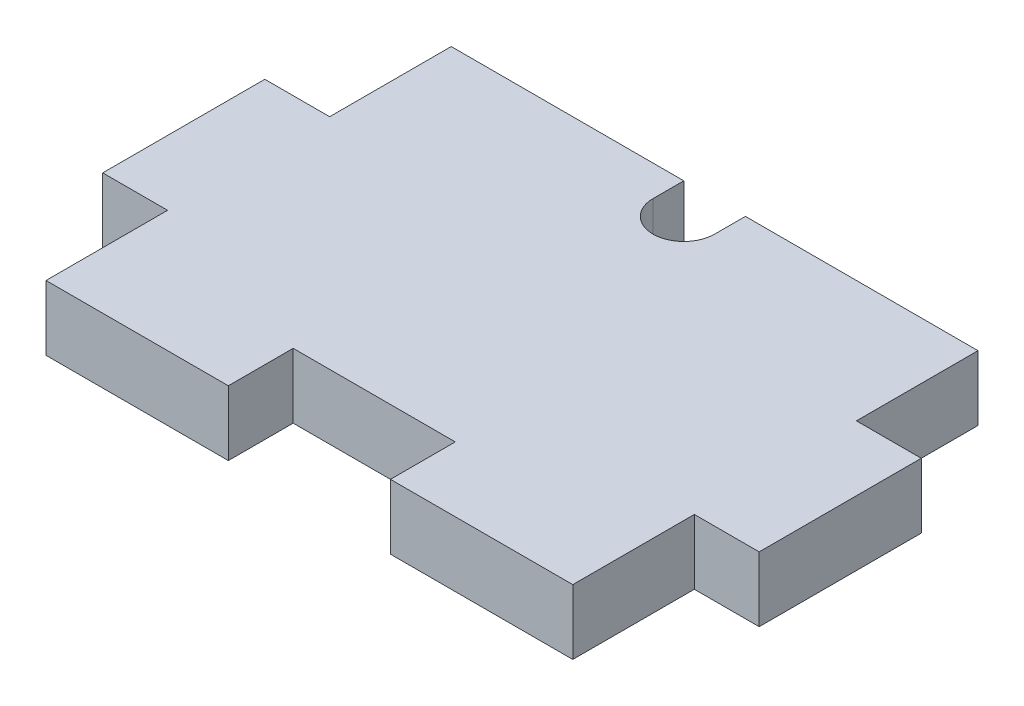
ISO-10303-21;
HEADER;
FILE_DESCRIPTION(('STEP AP214'),'2;1');
FILE_NAME('part.step','',(''),(''),'','','');
FILE_SCHEMA(('AUTOMOTIVE_DESIGN { 1 0 10303 214 1 1 1 1 }'));
ENDSEC;
DATA;
#1=APPLICATION_CONTEXT('core data for automotive mechanical design processes');
#2=APPLICATION_PROTOCOL_DEFINITION('international standard','automotive_design',2000,#1);
#3=PRODUCT_CONTEXT('',#1,'mechanical');
#4=PRODUCT('Part','Part','',(#3));
#5=PRODUCT_RELATED_PRODUCT_CATEGORY('part','',(#4));
#6=PRODUCT_DEFINITION_FORMATION('','',#4);
#7=PRODUCT_DEFINITION_CONTEXT('part definition',#1,'design');
#8=PRODUCT_DEFINITION('design','',#6,#7);
#9=PRODUCT_DEFINITION_SHAPE('','',#8);
#10=(LENGTH_UNIT() NAMED_UNIT(*) SI_UNIT(.MILLI.,.METRE.));
#11=(NAMED_UNIT(*) PLANE_ANGLE_UNIT() SI_UNIT($,.RADIAN.));
#12=(NAMED_UNIT(*) SI_UNIT($,.STERADIAN.) SOLID_ANGLE_UNIT());
#13=UNCERTAINTY_MEASURE_WITH_UNIT(LENGTH_MEASURE(1.E-05),#10,'distance_accuracy_value','');
#14=(GEOMETRIC_REPRESENTATION_CONTEXT(3) GLOBAL_UNCERTAINTY_ASSIGNED_CONTEXT((#13)) GLOBAL_UNIT_ASSIGNED_CONTEXT((#10,
#11,#12)) REPRESENTATION_CONTEXT('',''));
#15=CARTESIAN_POINT('',(0.,0.,0.));
#16=DIRECTION('',(0.,0.,1.));
#17=DIRECTION('',(1.,0.,0.));
#18=AXIS2_PLACEMENT_3D('',#15,#16,#17);
#19=CARTESIAN_POINT('',(0.,4.,25.));
#20=DIRECTION('',(0.,0.,-1.));
#21=DIRECTION('',(-1.,0.,0.));
#22=AXIS2_PLACEMENT_3D('',#19,#20,#21);
#23=PLANE('',#22);
#24=DIRECTION('',(1.,0.,0.));
#25=VECTOR('',#24,1.);
#26=CARTESIAN_POINT('',(0.,0.,25.));
#27=LINE('',#26,#25);
#28=CARTESIAN_POINT('',(0.,0.,25.));
#29=VERTEX_POINT('',#28);
#30=CARTESIAN_POINT('',(11.25,0.,25.));
#31=VERTEX_POINT('',#30);
#32=EDGE_CURVE('E192',#29,#31,#27,.T.);
#33=ORIENTED_EDGE('',*,*,#32,.T.);
#34=DIRECTION('',(0.,1.,0.));
#35=VECTOR('',#34,1.);
#36=CARTESIAN_POINT('',(11.25,0.,25.));
#37=LINE('',#36,#35);
#38=CARTESIAN_POINT('',(11.25,4.,25.));
#39=VERTEX_POINT('',#38);
#40=EDGE_CURVE('E174',#31,#39,#37,.T.);
#41=ORIENTED_EDGE('',*,*,#40,.T.);
#42=DIRECTION('',(1.,0.,0.));
#43=VECTOR('',#42,1.);
#44=CARTESIAN_POINT('',(0.,4.,25.));
#45=LINE('',#44,#43);
#46=CARTESIAN_POINT('',(0.,4.,25.));
#47=VERTEX_POINT('',#46);
#48=EDGE_CURVE('E316',#47,#39,#45,.T.);
#49=ORIENTED_EDGE('',*,*,#48,.F.);
#50=DIRECTION('',(0.,-1.,0.));
#51=VECTOR('',#50,1.);
#52=CARTESIAN_POINT('',(0.,4.,25.));
#53=LINE('',#52,#51);
#54=EDGE_CURVE('E12',#47,#29,#53,.T.);
#55=ORIENTED_EDGE('',*,*,#54,.T.);
#56=EDGE_LOOP('',(#33,#41,#49,#55));
#57=FACE_BOUND('',#56,.T.);
#58=ADVANCED_FACE('F37',(#57),#23,.F.);
#59=CARTESIAN_POINT('',(32.5,4.,0.));
#60=DIRECTION('',(-1.,0.,0.));
#61=DIRECTION('',(0.,0.,1.));
#62=AXIS2_PLACEMENT_3D('',#59,#60,#61);
#63=PLANE('',#62);
#64=DIRECTION('',(0.,1.,0.));
#65=VECTOR('',#64,1.);
#66=CARTESIAN_POINT('',(32.5,0.,7.5));
#67=LINE('',#66,#65);
#68=CARTESIAN_POINT('',(32.5,0.,7.5));
#69=VERTEX_POINT('',#68);
#70=CARTESIAN_POINT('',(32.5,4.,7.5));
#71=VERTEX_POINT('',#70);
#72=EDGE_CURVE('E247',#69,#71,#67,.T.);
#73=ORIENTED_EDGE('',*,*,#72,.F.);
#74=DIRECTION('',(0.,0.,-1.));
#75=VECTOR('',#74,1.);
#76=CARTESIAN_POINT('',(32.5,0.,0.));
#77=LINE('',#76,#75);
#78=CARTESIAN_POINT('',(32.5,0.,0.));
#79=VERTEX_POINT('',#78);
#80=EDGE_CURVE('E199',#69,#79,#77,.T.);
#81=ORIENTED_EDGE('',*,*,#80,.T.);
#82=DIRECTION('',(0.,-1.,0.));
#83=VECTOR('',#82,1.);
#84=CARTESIAN_POINT('',(32.5,4.,0.));
#85=LINE('',#84,#83);
#86=CARTESIAN_POINT('',(32.5,4.,0.));
#87=VERTEX_POINT('',#86);
#88=EDGE_CURVE('E328',#87,#79,#85,.T.);
#89=ORIENTED_EDGE('',*,*,#88,.F.);
#90=DIRECTION('',(0.,0.,-1.));
#91=VECTOR('',#90,1.);
#92=CARTESIAN_POINT('',(32.5,4.,0.));
#93=LINE('',#92,#91);
#94=EDGE_CURVE('E318',#71,#87,#93,.T.);
#95=ORIENTED_EDGE('',*,*,#94,.F.);
#96=EDGE_LOOP('',(#73,#81,#89,#95));
#97=FACE_BOUND('',#96,.T.);
#98=ADVANCED_FACE('F428',(#97),#63,.F.);
#99=CARTESIAN_POINT('',(0.,4.,0.));
#100=DIRECTION('',(1.,0.,0.));
#101=DIRECTION('',(0.,0.,-1.));
#102=AXIS2_PLACEMENT_3D('',#99,#100,#101);
#103=PLANE('',#102);
#104=DIRECTION('',(0.,1.,0.));
#105=VECTOR('',#104,1.);
#106=CARTESIAN_POINT('',(0.,0.,17.5));
#107=LINE('',#106,#105);
#108=CARTESIAN_POINT('',(0.,0.,17.5));
#109=VERTEX_POINT('',#108);
#110=CARTESIAN_POINT('',(0.,4.,17.5));
#111=VERTEX_POINT('',#110);
#112=EDGE_CURVE('E298',#109,#111,#107,.T.);
#113=ORIENTED_EDGE('',*,*,#112,.F.);
#114=DIRECTION('',(0.,0.,1.));
#115=VECTOR('',#114,1.);
#116=CARTESIAN_POINT('',(0.,0.,0.));
#117=LINE('',#116,#115);
#118=EDGE_CURVE('E305',#109,#29,#117,.T.);
#119=ORIENTED_EDGE('',*,*,#118,.T.);
#120=ORIENTED_EDGE('',*,*,#54,.F.);
#121=DIRECTION('',(0.,0.,1.));
#122=VECTOR('',#121,1.);
#123=CARTESIAN_POINT('',(0.,4.,0.));
#124=LINE('',#123,#122);
#125=EDGE_CURVE('E272',#111,#47,#124,.T.);
#126=ORIENTED_EDGE('',*,*,#125,.F.);
#127=EDGE_LOOP('',(#113,#119,#120,#126));
#128=FACE_BOUND('',#127,.T.);
#129=ADVANCED_FACE('F374',(#128),#103,.F.);
#130=CARTESIAN_POINT('',(0.,4.,0.));
#131=DIRECTION('',(0.,0.,1.));
#132=DIRECTION('',(1.,0.,0.));
#133=AXIS2_PLACEMENT_3D('',#130,#131,#132);
#134=PLANE('',#133);
#135=DIRECTION('',(0.,1.,0.));
#136=VECTOR('',#135,1.);
#137=CARTESIAN_POINT('',(14.35,0.,0.));
#138=LINE('',#137,#136);
#139=CARTESIAN_POINT('',(14.35,0.,0.));
#140=VERTEX_POINT('',#139);
#141=CARTESIAN_POINT('',(14.35,4.,0.));
#142=VERTEX_POINT('',#141);
#143=EDGE_CURVE('E306',#140,#142,#138,.T.);
#144=ORIENTED_EDGE('',*,*,#143,.F.);
#145=DIRECTION('',(-1.,0.,0.));
#146=VECTOR('',#145,1.);
#147=CARTESIAN_POINT('',(0.,0.,0.));
#148=LINE('',#147,#146);
#149=CARTESIAN_POINT('',(0.,0.,0.));
#150=VERTEX_POINT('',#149);
#151=EDGE_CURVE('E273',#140,#150,#148,.T.);
#152=ORIENTED_EDGE('',*,*,#151,.T.);
#153=DIRECTION('',(0.,-1.,0.));
#154=VECTOR('',#153,1.);
#155=CARTESIAN_POINT('',(0.,4.,0.));
#156=LINE('',#155,#154);
#157=CARTESIAN_POINT('',(0.,4.,0.));
#158=VERTEX_POINT('',#157);
#159=EDGE_CURVE('E274',#158,#150,#156,.T.);
#160=ORIENTED_EDGE('',*,*,#159,.F.);
#161=DIRECTION('',(-1.,0.,0.));
#162=VECTOR('',#161,1.);
#163=CARTESIAN_POINT('',(0.,4.,0.));
#164=LINE('',#163,#162);
#165=EDGE_CURVE('E321',#142,#158,#164,.T.);
#166=ORIENTED_EDGE('',*,*,#165,.F.);
#167=EDGE_LOOP('',(#144,#152,#160,#166));
#168=FACE_BOUND('',#167,.T.);
#169=ADVANCED_FACE('F338',(#168),#134,.F.);
#170=CARTESIAN_POINT('',(0.,4.,0.));
#171=DIRECTION('',(0.,1.,0.));
#172=DIRECTION('',(0.,0.,1.));
#173=AXIS2_PLACEMENT_3D('',#170,#171,#172);
#174=PLANE('',#173);
#175=DIRECTION('',(0.,0.,1.));
#176=VECTOR('',#175,1.);
#177=CARTESIAN_POINT('',(11.25,4.,21.));
#178=LINE('',#177,#176);
#179=CARTESIAN_POINT('',(11.25,4.,21.));
#180=VERTEX_POINT('',#179);
#181=EDGE_CURVE('E180',#180,#39,#178,.T.);
#182=ORIENTED_EDGE('',*,*,#181,.F.);
#183=DIRECTION('',(-1.,0.,0.));
#184=VECTOR('',#183,1.);
#185=CARTESIAN_POINT('',(11.25,4.,21.));
#186=LINE('',#185,#184);
#187=CARTESIAN_POINT('',(21.25,4.,21.));
#188=VERTEX_POINT('',#187);
#189=EDGE_CURVE('E195',#188,#180,#186,.T.);
#190=ORIENTED_EDGE('',*,*,#189,.F.);
#191=DIRECTION('',(0.,0.,-1.));
#192=VECTOR('',#191,1.);
#193=CARTESIAN_POINT('',(21.25,4.,21.));
#194=LINE('',#193,#192);
#195=CARTESIAN_POINT('',(21.25,4.,25.));
#196=VERTEX_POINT('',#195);
#197=EDGE_CURVE('E395',#196,#188,#194,.T.);
#198=ORIENTED_EDGE('',*,*,#197,.F.);
#199=CARTESIAN_POINT('',(32.5,4.,25.));
#200=VERTEX_POINT('',#199);
#201=EDGE_CURVE('E315',#196,#200,#45,.T.);
#202=ORIENTED_EDGE('',*,*,#201,.T.);
#203=CARTESIAN_POINT('',(32.5,4.,17.5));
#204=VERTEX_POINT('',#203);
#205=EDGE_CURVE('E319',#200,#204,#93,.T.);
#206=ORIENTED_EDGE('',*,*,#205,.T.);
#207=DIRECTION('',(1.,0.,0.));
#208=VECTOR('',#207,1.);
#209=CARTESIAN_POINT('',(32.5,4.,17.5));
#210=LINE('',#209,#208);
#211=CARTESIAN_POINT('',(36.5,4.,17.5));
#212=VERTEX_POINT('',#211);
#213=EDGE_CURVE('E60',#204,#212,#210,.T.);
#214=ORIENTED_EDGE('',*,*,#213,.T.);
#215=DIRECTION('',(0.,0.,-1.));
#216=VECTOR('',#215,1.);
#217=CARTESIAN_POINT('',(36.5,4.,7.5));
#218=LINE('',#217,#216);
#219=CARTESIAN_POINT('',(36.5,4.,7.5));
#220=VERTEX_POINT('',#219);
#221=EDGE_CURVE('E233',#212,#220,#218,.T.);
#222=ORIENTED_EDGE('',*,*,#221,.T.);
#223=DIRECTION('',(-1.,0.,0.));
#224=VECTOR('',#223,1.);
#225=CARTESIAN_POINT('',(32.5,4.,7.5));
#226=LINE('',#225,#224);
#227=EDGE_CURVE('E236',#220,#71,#226,.T.);
#228=ORIENTED_EDGE('',*,*,#227,.T.);
#229=ORIENTED_EDGE('',*,*,#94,.T.);
#230=CARTESIAN_POINT('',(18.15,4.,0.));
#231=VERTEX_POINT('',#230);
#232=EDGE_CURVE('E322',#87,#231,#164,.T.);
#233=ORIENTED_EDGE('',*,*,#232,.T.);
#234=DIRECTION('',(0.,0.,-1.));
#235=VECTOR('',#234,1.);
#236=CARTESIAN_POINT('',(18.15,4.,0.));
#237=LINE('',#236,#235);
#238=CARTESIAN_POINT('',(18.15,4.,1.9));
#239=VERTEX_POINT('',#238);
#240=EDGE_CURVE('E297',#239,#231,#237,.T.);
#241=ORIENTED_EDGE('',*,*,#240,.F.);
#242=CARTESIAN_POINT('',(16.25,4.,1.9));
#243=DIRECTION('',(0.,1.,0.));
#244=DIRECTION('',(0.,0.,1.));
#245=AXIS2_PLACEMENT_3D('',#242,#243,#244);
#246=CIRCLE('',#245,1.9);
#247=CARTESIAN_POINT('',(14.35,4.,1.9));
#248=VERTEX_POINT('',#247);
#249=EDGE_CURVE('E294',#248,#239,#246,.T.);
#250=ORIENTED_EDGE('',*,*,#249,.F.);
#251=DIRECTION('',(0.,0.,-1.));
#252=VECTOR('',#251,1.);
#253=CARTESIAN_POINT('',(14.35,4.,0.));
#254=LINE('',#253,#252);
#255=EDGE_CURVE('E300',#248,#142,#254,.T.);
#256=ORIENTED_EDGE('',*,*,#255,.T.);
#257=ORIENTED_EDGE('',*,*,#165,.T.);
#258=CARTESIAN_POINT('',(0.,4.,7.5));
#259=VERTEX_POINT('',#258);
#260=EDGE_CURVE('E312',#158,#259,#124,.T.);
#261=ORIENTED_EDGE('',*,*,#260,.T.);
#262=DIRECTION('',(-1.,0.,0.));
#263=VECTOR('',#262,1.);
#264=CARTESIAN_POINT('',(-4.,4.,7.5));
#265=LINE('',#264,#263);
#266=CARTESIAN_POINT('',(-4.,4.,7.5));
#267=VERTEX_POINT('',#266);
#268=EDGE_CURVE('E244',#259,#267,#265,.T.);
#269=ORIENTED_EDGE('',*,*,#268,.T.);
#270=DIRECTION('',(0.,0.,1.));
#271=VECTOR('',#270,1.);
#272=CARTESIAN_POINT('',(-4.,4.,7.5));
#273=LINE('',#272,#271);
#274=CARTESIAN_POINT('',(-4.,4.,17.5));
#275=VERTEX_POINT('',#274);
#276=EDGE_CURVE('E357',#267,#275,#273,.T.);
#277=ORIENTED_EDGE('',*,*,#276,.T.);
#278=DIRECTION('',(1.,0.,0.));
#279=VECTOR('',#278,1.);
#280=CARTESIAN_POINT('',(-4.,4.,17.5));
#281=LINE('',#280,#279);
#282=EDGE_CURVE('E256',#275,#111,#281,.T.);
#283=ORIENTED_EDGE('',*,*,#282,.T.);
#284=ORIENTED_EDGE('',*,*,#125,.T.);
#285=ORIENTED_EDGE('',*,*,#48,.T.);
#286=EDGE_LOOP('',(#182,#190,#198,#202,#206,#214,#222,#228,#229,#233,#241,#250,#256,#257,#261,
#269,#277,#283,#284,#285));
#287=FACE_BOUND('',#286,.T.);
#288=ADVANCED_FACE('F331',(#287),#174,.T.);
#289=CARTESIAN_POINT('',(0.,0.,0.));
#290=DIRECTION('',(0.,1.,0.));
#291=DIRECTION('',(0.,0.,1.));
#292=AXIS2_PLACEMENT_3D('',#289,#290,#291);
#293=PLANE('',#292);
#294=DIRECTION('',(-1.,0.,0.));
#295=VECTOR('',#294,1.);
#296=CARTESIAN_POINT('',(11.25,0.,21.));
#297=LINE('',#296,#295);
#298=CARTESIAN_POINT('',(21.25,0.,21.));
#299=VERTEX_POINT('',#298);
#300=CARTESIAN_POINT('',(11.25,0.,21.));
#301=VERTEX_POINT('',#300);
#302=EDGE_CURVE('E186',#299,#301,#297,.T.);
#303=ORIENTED_EDGE('',*,*,#302,.T.);
#304=DIRECTION('',(0.,0.,1.));
#305=VECTOR('',#304,1.);
#306=CARTESIAN_POINT('',(11.25,0.,21.));
#307=LINE('',#306,#305);
#308=EDGE_CURVE('E177',#301,#31,#307,.T.);
#309=ORIENTED_EDGE('',*,*,#308,.T.);
#310=ORIENTED_EDGE('',*,*,#32,.F.);
#311=ORIENTED_EDGE('',*,*,#118,.F.);
#312=DIRECTION('',(1.,0.,0.));
#313=VECTOR('',#312,1.);
#314=CARTESIAN_POINT('',(-4.,0.,17.5));
#315=LINE('',#314,#313);
#316=CARTESIAN_POINT('',(-4.,0.,17.5));
#317=VERTEX_POINT('',#316);
#318=EDGE_CURVE('E348',#317,#109,#315,.T.);
#319=ORIENTED_EDGE('',*,*,#318,.F.);
#320=DIRECTION('',(0.,0.,1.));
#321=VECTOR('',#320,1.);
#322=CARTESIAN_POINT('',(-4.,0.,7.5));
#323=LINE('',#322,#321);
#324=CARTESIAN_POINT('',(-4.,0.,7.5));
#325=VERTEX_POINT('',#324);
#326=EDGE_CURVE('E255',#325,#317,#323,.T.);
#327=ORIENTED_EDGE('',*,*,#326,.F.);
#328=DIRECTION('',(-1.,0.,0.));
#329=VECTOR('',#328,1.);
#330=CARTESIAN_POINT('',(-4.,0.,7.5));
#331=LINE('',#330,#329);
#332=CARTESIAN_POINT('',(0.,0.,7.5));
#333=VERTEX_POINT('',#332);
#334=EDGE_CURVE('E250',#333,#325,#331,.T.);
#335=ORIENTED_EDGE('',*,*,#334,.F.);
#336=EDGE_CURVE('E207',#150,#333,#117,.T.);
#337=ORIENTED_EDGE('',*,*,#336,.F.);
#338=ORIENTED_EDGE('',*,*,#151,.F.);
#339=DIRECTION('',(0.,0.,-1.));
#340=VECTOR('',#339,1.);
#341=CARTESIAN_POINT('',(14.35,0.,0.));
#342=LINE('',#341,#340);
#343=CARTESIAN_POINT('',(14.35,0.,1.9));
#344=VERTEX_POINT('',#343);
#345=EDGE_CURVE('E286',#344,#140,#342,.T.);
#346=ORIENTED_EDGE('',*,*,#345,.F.);
#347=CARTESIAN_POINT('',(16.25,0.,1.9));
#348=DIRECTION('',(0.,1.,0.));
#349=DIRECTION('',(0.,0.,1.));
#350=AXIS2_PLACEMENT_3D('',#347,#348,#349);
#351=CIRCLE('',#350,1.9);
#352=CARTESIAN_POINT('',(18.15,0.,1.9));
#353=VERTEX_POINT('',#352);
#354=EDGE_CURVE('E287',#344,#353,#351,.T.);
#355=ORIENTED_EDGE('',*,*,#354,.T.);
#356=DIRECTION('',(0.,0.,-1.));
#357=VECTOR('',#356,1.);
#358=CARTESIAN_POINT('',(18.15,0.,0.));
#359=LINE('',#358,#357);
#360=CARTESIAN_POINT('',(18.15,0.,0.));
#361=VERTEX_POINT('',#360);
#362=EDGE_CURVE('E282',#353,#361,#359,.T.);
#363=ORIENTED_EDGE('',*,*,#362,.T.);
#364=EDGE_CURVE('E267',#79,#361,#148,.T.);
#365=ORIENTED_EDGE('',*,*,#364,.F.);
#366=ORIENTED_EDGE('',*,*,#80,.F.);
#367=DIRECTION('',(-1.,0.,0.));
#368=VECTOR('',#367,1.);
#369=CARTESIAN_POINT('',(32.5,0.,7.5));
#370=LINE('',#369,#368);
#371=CARTESIAN_POINT('',(36.5,0.,7.5));
#372=VERTEX_POINT('',#371);
#373=EDGE_CURVE('E231',#372,#69,#370,.T.);
#374=ORIENTED_EDGE('',*,*,#373,.F.);
#375=DIRECTION('',(0.,0.,-1.));
#376=VECTOR('',#375,1.);
#377=CARTESIAN_POINT('',(36.5,0.,7.5));
#378=LINE('',#377,#376);
#379=CARTESIAN_POINT('',(36.5,0.,17.5));
#380=VERTEX_POINT('',#379);
#381=EDGE_CURVE('E241',#380,#372,#378,.T.);
#382=ORIENTED_EDGE('',*,*,#381,.F.);
#383=DIRECTION('',(1.,0.,0.));
#384=VECTOR('',#383,1.);
#385=CARTESIAN_POINT('',(32.5,0.,17.5));
#386=LINE('',#385,#384);
#387=CARTESIAN_POINT('',(32.5,0.,17.5));
#388=VERTEX_POINT('',#387);
#389=EDGE_CURVE('E224',#388,#380,#386,.T.);
#390=ORIENTED_EDGE('',*,*,#389,.F.);
#391=CARTESIAN_POINT('',(32.5,0.,25.));
#392=VERTEX_POINT('',#391);
#393=EDGE_CURVE('E204',#392,#388,#77,.T.);
#394=ORIENTED_EDGE('',*,*,#393,.F.);
#395=CARTESIAN_POINT('',(21.25,0.,25.));
#396=VERTEX_POINT('',#395);
#397=EDGE_CURVE('E200',#396,#392,#27,.T.);
#398=ORIENTED_EDGE('',*,*,#397,.F.);
#399=DIRECTION('',(0.,0.,-1.));
#400=VECTOR('',#399,1.);
#401=CARTESIAN_POINT('',(21.25,0.,21.));
#402=LINE('',#401,#400);
#403=EDGE_CURVE('E52',#396,#299,#402,.T.);
#404=ORIENTED_EDGE('',*,*,#403,.T.);
#405=EDGE_LOOP('',(#303,#309,#310,#311,#319,#327,#335,#337,#338,#346,#355,#363,#365,#366,#374,
#382,#390,#394,#398,#404));
#406=FACE_BOUND('',#405,.T.);
#407=ADVANCED_FACE('F190',(#406),#293,.F.);
#408=ORIENTED_EDGE('',*,*,#336,.T.);
#409=DIRECTION('',(0.,1.,0.));
#410=VECTOR('',#409,1.);
#411=CARTESIAN_POINT('',(0.,0.,7.5));
#412=LINE('',#411,#410);
#413=EDGE_CURVE('E344',#333,#259,#412,.T.);
#414=ORIENTED_EDGE('',*,*,#413,.T.);
#415=ORIENTED_EDGE('',*,*,#260,.F.);
#416=ORIENTED_EDGE('',*,*,#159,.T.);
#417=EDGE_LOOP('',(#408,#414,#415,#416));
#418=FACE_BOUND('',#417,.T.);
#419=ADVANCED_FACE('F39',(#418),#103,.F.);
#420=ORIENTED_EDGE('',*,*,#201,.F.);
#421=DIRECTION('',(0.,1.,0.));
#422=VECTOR('',#421,1.);
#423=CARTESIAN_POINT('',(21.25,0.,25.));
#424=LINE('',#423,#422);
#425=EDGE_CURVE('E185',#396,#196,#424,.T.);
#426=ORIENTED_EDGE('',*,*,#425,.F.);
#427=ORIENTED_EDGE('',*,*,#397,.T.);
#428=DIRECTION('',(0.,-1.,0.));
#429=VECTOR('',#428,1.);
#430=CARTESIAN_POINT('',(32.5,4.,25.));
#431=LINE('',#430,#429);
#432=EDGE_CURVE('E45',#200,#392,#431,.T.);
#433=ORIENTED_EDGE('',*,*,#432,.F.);
#434=EDGE_LOOP('',(#420,#426,#427,#433));
#435=FACE_BOUND('',#434,.T.);
#436=ADVANCED_FACE('F410',(#435),#23,.F.);
#437=ORIENTED_EDGE('',*,*,#393,.T.);
#438=DIRECTION('',(0.,1.,0.));
#439=VECTOR('',#438,1.);
#440=CARTESIAN_POINT('',(32.5,0.,17.5));
#441=LINE('',#440,#439);
#442=EDGE_CURVE('E245',#388,#204,#441,.T.);
#443=ORIENTED_EDGE('',*,*,#442,.T.);
#444=ORIENTED_EDGE('',*,*,#205,.F.);
#445=ORIENTED_EDGE('',*,*,#432,.T.);
#446=EDGE_LOOP('',(#437,#443,#444,#445));
#447=FACE_BOUND('',#446,.T.);
#448=ADVANCED_FACE('F415',(#447),#63,.F.);
#449=ORIENTED_EDGE('',*,*,#364,.T.);
#450=DIRECTION('',(0.,1.,0.));
#451=VECTOR('',#450,1.);
#452=CARTESIAN_POINT('',(18.15,0.,0.));
#453=LINE('',#452,#451);
#454=EDGE_CURVE('E308',#361,#231,#453,.T.);
#455=ORIENTED_EDGE('',*,*,#454,.T.);
#456=ORIENTED_EDGE('',*,*,#232,.F.);
#457=ORIENTED_EDGE('',*,*,#88,.T.);
#458=EDGE_LOOP('',(#449,#455,#456,#457));
#459=FACE_BOUND('',#458,.T.);
#460=ADVANCED_FACE('F434',(#459),#134,.F.);
#461=CARTESIAN_POINT('',(16.25,0.,1.9));
#462=DIRECTION('',(0.,1.,0.));
#463=DIRECTION('',(0.,0.,1.));
#464=AXIS2_PLACEMENT_3D('',#461,#462,#463);
#465=CYLINDRICAL_SURFACE('',#464,1.9);
#466=ORIENTED_EDGE('',*,*,#249,.T.);
#467=DIRECTION('',(0.,1.,0.));
#468=VECTOR('',#467,1.);
#469=CARTESIAN_POINT('',(18.15,0.,1.9));
#470=LINE('',#469,#468);
#471=EDGE_CURVE('E293',#353,#239,#470,.T.);
#472=ORIENTED_EDGE('',*,*,#471,.F.);
#473=ORIENTED_EDGE('',*,*,#354,.F.);
#474=DIRECTION('',(0.,1.,0.));
#475=VECTOR('',#474,1.);
#476=CARTESIAN_POINT('',(14.35,0.,1.9));
#477=LINE('',#476,#475);
#478=EDGE_CURVE('E303',#344,#248,#477,.T.);
#479=ORIENTED_EDGE('',*,*,#478,.T.);
#480=EDGE_LOOP('',(#466,#472,#473,#479));
#481=FACE_BOUND('',#480,.T.);
#482=ADVANCED_FACE('F438',(#481),#465,.F.);
#483=CARTESIAN_POINT('',(14.35,0.,0.));
#484=DIRECTION('',(1.,0.,0.));
#485=DIRECTION('',(0.,0.,-1.));
#486=AXIS2_PLACEMENT_3D('',#483,#484,#485);
#487=PLANE('',#486);
#488=ORIENTED_EDGE('',*,*,#255,.F.);
#489=ORIENTED_EDGE('',*,*,#478,.F.);
#490=ORIENTED_EDGE('',*,*,#345,.T.);
#491=ORIENTED_EDGE('',*,*,#143,.T.);
#492=EDGE_LOOP('',(#488,#489,#490,#491));
#493=FACE_BOUND('',#492,.T.);
#494=ADVANCED_FACE('F442',(#493),#487,.T.);
#495=CARTESIAN_POINT('',(18.15,0.,0.));
#496=DIRECTION('',(1.,0.,0.));
#497=DIRECTION('',(0.,0.,-1.));
#498=AXIS2_PLACEMENT_3D('',#495,#496,#497);
#499=PLANE('',#498);
#500=ORIENTED_EDGE('',*,*,#240,.T.);
#501=ORIENTED_EDGE('',*,*,#454,.F.);
#502=ORIENTED_EDGE('',*,*,#362,.F.);
#503=ORIENTED_EDGE('',*,*,#471,.T.);
#504=EDGE_LOOP('',(#500,#501,#502,#503));
#505=FACE_BOUND('',#504,.T.);
#506=ADVANCED_FACE('F436',(#505),#499,.F.);
#507=CARTESIAN_POINT('',(-4.,0.,17.5));
#508=DIRECTION('',(0.,0.,1.));
#509=DIRECTION('',(1.,0.,0.));
#510=AXIS2_PLACEMENT_3D('',#507,#508,#509);
#511=PLANE('',#510);
#512=ORIENTED_EDGE('',*,*,#282,.F.);
#513=DIRECTION('',(0.,1.,0.));
#514=VECTOR('',#513,1.);
#515=CARTESIAN_POINT('',(-4.,0.,17.5));
#516=LINE('',#515,#514);
#517=EDGE_CURVE('E349',#317,#275,#516,.T.);
#518=ORIENTED_EDGE('',*,*,#517,.F.);
#519=ORIENTED_EDGE('',*,*,#318,.T.);
#520=ORIENTED_EDGE('',*,*,#112,.T.);
#521=EDGE_LOOP('',(#512,#518,#519,#520));
#522=FACE_BOUND('',#521,.T.);
#523=ADVANCED_FACE('F370',(#522),#511,.T.);
#524=CARTESIAN_POINT('',(-4.,0.,7.5));
#525=DIRECTION('',(-1.,0.,0.));
#526=DIRECTION('',(0.,0.,1.));
#527=AXIS2_PLACEMENT_3D('',#524,#525,#526);
#528=PLANE('',#527);
#529=ORIENTED_EDGE('',*,*,#276,.F.);
#530=DIRECTION('',(0.,1.,0.));
#531=VECTOR('',#530,1.);
#532=CARTESIAN_POINT('',(-4.,0.,7.5));
#533=LINE('',#532,#531);
#534=EDGE_CURVE('E347',#325,#267,#533,.T.);
#535=ORIENTED_EDGE('',*,*,#534,.F.);
#536=ORIENTED_EDGE('',*,*,#326,.T.);
#537=ORIENTED_EDGE('',*,*,#517,.T.);
#538=EDGE_LOOP('',(#529,#535,#536,#537));
#539=FACE_BOUND('',#538,.T.);
#540=ADVANCED_FACE('F367',(#539),#528,.T.);
#541=CARTESIAN_POINT('',(-4.,0.,7.5));
#542=DIRECTION('',(0.,0.,-1.));
#543=DIRECTION('',(-1.,0.,0.));
#544=AXIS2_PLACEMENT_3D('',#541,#542,#543);
#545=PLANE('',#544);
#546=ORIENTED_EDGE('',*,*,#268,.F.);
#547=ORIENTED_EDGE('',*,*,#413,.F.);
#548=ORIENTED_EDGE('',*,*,#334,.T.);
#549=ORIENTED_EDGE('',*,*,#534,.T.);
#550=EDGE_LOOP('',(#546,#547,#548,#549));
#551=FACE_BOUND('',#550,.T.);
#552=ADVANCED_FACE('F363',(#551),#545,.T.);
#553=CARTESIAN_POINT('',(36.5,0.,7.5));
#554=DIRECTION('',(1.,0.,0.));
#555=DIRECTION('',(0.,0.,-1.));
#556=AXIS2_PLACEMENT_3D('',#553,#554,#555);
#557=PLANE('',#556);
#558=ORIENTED_EDGE('',*,*,#221,.F.);
#559=DIRECTION('',(0.,1.,0.));
#560=VECTOR('',#559,1.);
#561=CARTESIAN_POINT('',(36.5,0.,17.5));
#562=LINE('',#561,#560);
#563=EDGE_CURVE('E242',#380,#212,#562,.T.);
#564=ORIENTED_EDGE('',*,*,#563,.F.);
#565=ORIENTED_EDGE('',*,*,#381,.T.);
#566=DIRECTION('',(0.,1.,0.));
#567=VECTOR('',#566,1.);
#568=CARTESIAN_POINT('',(36.5,0.,7.5));
#569=LINE('',#568,#567);
#570=EDGE_CURVE('E230',#372,#220,#569,.T.);
#571=ORIENTED_EDGE('',*,*,#570,.T.);
#572=EDGE_LOOP('',(#558,#564,#565,#571));
#573=FACE_BOUND('',#572,.T.);
#574=ADVANCED_FACE('F420',(#573),#557,.T.);
#575=CARTESIAN_POINT('',(32.5,0.,17.5));
#576=DIRECTION('',(0.,0.,1.));
#577=DIRECTION('',(1.,0.,0.));
#578=AXIS2_PLACEMENT_3D('',#575,#576,#577);
#579=PLANE('',#578);
#580=ORIENTED_EDGE('',*,*,#213,.F.);
#581=ORIENTED_EDGE('',*,*,#442,.F.);
#582=ORIENTED_EDGE('',*,*,#389,.T.);
#583=ORIENTED_EDGE('',*,*,#563,.T.);
#584=EDGE_LOOP('',(#580,#581,#582,#583));
#585=FACE_BOUND('',#584,.T.);
#586=ADVANCED_FACE('F543',(#585),#579,.T.);
#587=CARTESIAN_POINT('',(32.5,0.,7.5));
#588=DIRECTION('',(0.,0.,-1.));
#589=DIRECTION('',(-1.,0.,0.));
#590=AXIS2_PLACEMENT_3D('',#587,#588,#589);
#591=PLANE('',#590);
#592=ORIENTED_EDGE('',*,*,#227,.F.);
#593=ORIENTED_EDGE('',*,*,#570,.F.);
#594=ORIENTED_EDGE('',*,*,#373,.T.);
#595=ORIENTED_EDGE('',*,*,#72,.T.);
#596=EDGE_LOOP('',(#592,#593,#594,#595));
#597=FACE_BOUND('',#596,.T.);
#598=ADVANCED_FACE('F424',(#597),#591,.T.);
#599=CARTESIAN_POINT('',(11.25,0.,21.));
#600=DIRECTION('',(-1.,0.,0.));
#601=DIRECTION('',(0.,0.,1.));
#602=AXIS2_PLACEMENT_3D('',#599,#600,#601);
#603=PLANE('',#602);
#604=ORIENTED_EDGE('',*,*,#181,.T.);
#605=ORIENTED_EDGE('',*,*,#40,.F.);
#606=ORIENTED_EDGE('',*,*,#308,.F.);
#607=DIRECTION('',(0.,1.,0.));
#608=VECTOR('',#607,1.);
#609=CARTESIAN_POINT('',(11.25,0.,21.));
#610=LINE('',#609,#608);
#611=EDGE_CURVE('E237',#301,#180,#610,.T.);
#612=ORIENTED_EDGE('',*,*,#611,.T.);
#613=EDGE_LOOP('',(#604,#605,#606,#612));
#614=FACE_BOUND('',#613,.T.);
#615=ADVANCED_FACE('F176',(#614),#603,.F.);
#616=CARTESIAN_POINT('',(11.25,0.,21.));
#617=DIRECTION('',(0.,0.,-1.));
#618=DIRECTION('',(-1.,0.,0.));
#619=AXIS2_PLACEMENT_3D('',#616,#617,#618);
#620=PLANE('',#619);
#621=ORIENTED_EDGE('',*,*,#189,.T.);
#622=ORIENTED_EDGE('',*,*,#611,.F.);
#623=ORIENTED_EDGE('',*,*,#302,.F.);
#624=DIRECTION('',(0.,1.,0.));
#625=VECTOR('',#624,1.);
#626=CARTESIAN_POINT('',(21.25,0.,21.));
#627=LINE('',#626,#625);
#628=EDGE_CURVE('E401',#299,#188,#627,.T.);
#629=ORIENTED_EDGE('',*,*,#628,.T.);
#630=EDGE_LOOP('',(#621,#622,#623,#629));
#631=FACE_BOUND('',#630,.T.);
#632=ADVANCED_FACE('F565',(#631),#620,.F.);
#633=CARTESIAN_POINT('',(21.25,0.,21.));
#634=DIRECTION('',(1.,0.,0.));
#635=DIRECTION('',(0.,0.,-1.));
#636=AXIS2_PLACEMENT_3D('',#633,#634,#635);
#637=PLANE('',#636);
#638=ORIENTED_EDGE('',*,*,#197,.T.);
#639=ORIENTED_EDGE('',*,*,#628,.F.);
#640=ORIENTED_EDGE('',*,*,#403,.F.);
#641=ORIENTED_EDGE('',*,*,#425,.T.);
#642=EDGE_LOOP('',(#638,#639,#640,#641));
#643=FACE_BOUND('',#642,.T.);
#644=ADVANCED_FACE('F405',(#643),#637,.F.);
#645=CLOSED_SHELL('',(#58,#98,#129,#169,#288,#407,#419,#436,#448,#460,#482,#494,#506,#523,#540,
#552,#574,#586,#598,#615,#632,#644));
#646=MANIFOLD_SOLID_BREP('B2',#645);
#647=ADVANCED_BREP_SHAPE_REPRESENTATION('',(#18,#646),#14);
#648=SHAPE_DEFINITION_REPRESENTATION(#9,#647);
ENDSEC;
END-ISO-10303-21;
